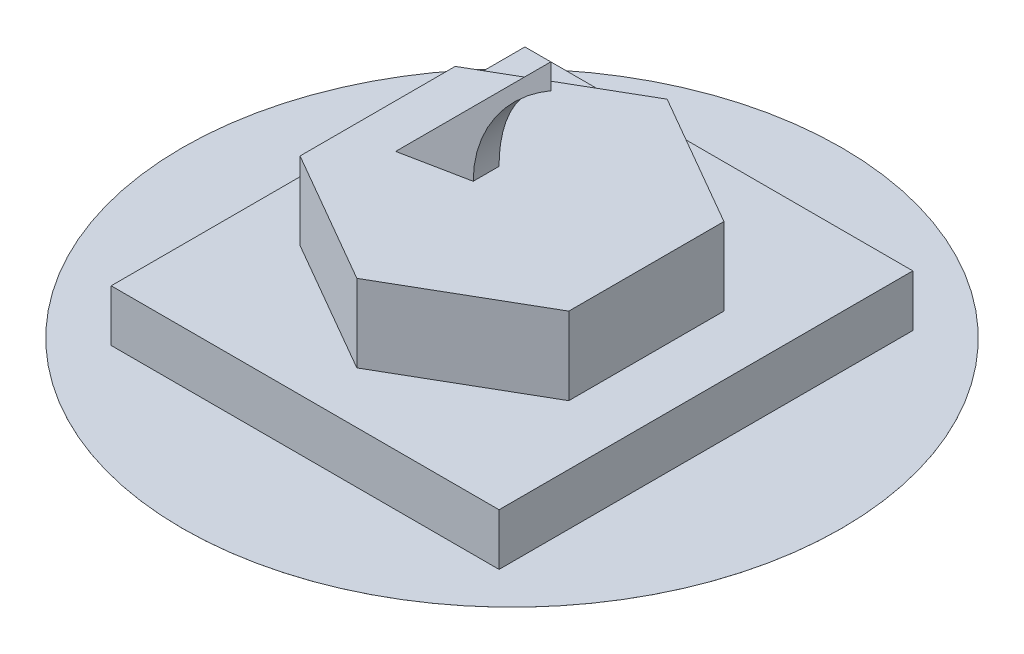
ISO-10303-21;
HEADER;
FILE_DESCRIPTION(('STEP AP214'),'2;1');
FILE_NAME('part.step','',(''),(''),'','','');
FILE_SCHEMA(('AUTOMOTIVE_DESIGN { 1 0 10303 214 1 1 1 1 }'));
ENDSEC;
DATA;
#1=APPLICATION_CONTEXT('core data for automotive mechanical design processes');
#2=APPLICATION_PROTOCOL_DEFINITION('international standard','automotive_design',2000,#1);
#3=PRODUCT_CONTEXT('',#1,'mechanical');
#4=PRODUCT('Part','Part','',(#3));
#5=PRODUCT_RELATED_PRODUCT_CATEGORY('part','',(#4));
#6=PRODUCT_DEFINITION_FORMATION('','',#4);
#7=PRODUCT_DEFINITION_CONTEXT('part definition',#1,'design');
#8=PRODUCT_DEFINITION('design','',#6,#7);
#9=PRODUCT_DEFINITION_SHAPE('','',#8);
#10=(LENGTH_UNIT() NAMED_UNIT(*) SI_UNIT(.MILLI.,.METRE.));
#11=(NAMED_UNIT(*) PLANE_ANGLE_UNIT() SI_UNIT($,.RADIAN.));
#12=(NAMED_UNIT(*) SI_UNIT($,.STERADIAN.) SOLID_ANGLE_UNIT());
#13=UNCERTAINTY_MEASURE_WITH_UNIT(LENGTH_MEASURE(1.E-05),#10,'distance_accuracy_value','');
#14=(GEOMETRIC_REPRESENTATION_CONTEXT(3) GLOBAL_UNCERTAINTY_ASSIGNED_CONTEXT((#13)) GLOBAL_UNIT_ASSIGNED_CONTEXT((#10,
#11,#12)) REPRESENTATION_CONTEXT('',''));
#15=CARTESIAN_POINT('',(0.,0.,0.));
#16=DIRECTION('',(0.,0.,1.));
#17=DIRECTION('',(1.,0.,0.));
#18=AXIS2_PLACEMENT_3D('',#15,#16,#17);
#19=CARTESIAN_POINT('',(75.,50.,-140.));
#20=DIRECTION('',(0.,1.,0.));
#21=DIRECTION('',(0.,0.,1.));
#22=AXIS2_PLACEMENT_3D('',#19,#20,#21);
#23=PLANE('',#22);
#24=DIRECTION('',(0.98058067569092,0.,-0.196116135138184));
#25=VECTOR('',#24,1.);
#26=CARTESIAN_POINT('',(40.,50.,-70.));
#27=LINE('',#26,#25);
#28=CARTESIAN_POINT('',(40.,50.,-70.));
#29=VERTEX_POINT('',#28);
#30=CARTESIAN_POINT('',(65.,50.,-75.));
#31=VERTEX_POINT('',#30);
#32=EDGE_CURVE('E159',#29,#31,#27,.T.);
#33=ORIENTED_EDGE('',*,*,#32,.F.);
#34=DIRECTION('',(0.,0.,1.));
#35=VECTOR('',#34,1.);
#36=CARTESIAN_POINT('',(40.,50.,-90.));
#37=LINE('',#36,#35);
#38=CARTESIAN_POINT('',(40.,50.,-90.));
#39=VERTEX_POINT('',#38);
#40=EDGE_CURVE('E172',#39,#29,#37,.T.);
#41=ORIENTED_EDGE('',*,*,#40,.F.);
#42=DIRECTION('',(-0.98058067569092,0.,-0.196116135138184));
#43=VECTOR('',#42,1.);
#44=CARTESIAN_POINT('',(90.,50.,-80.));
#45=LINE('',#44,#43);
#46=CARTESIAN_POINT('',(65.,50.,-85.));
#47=VERTEX_POINT('',#46);
#48=EDGE_CURVE('E244',#47,#39,#45,.T.);
#49=ORIENTED_EDGE('',*,*,#48,.F.);
#50=DIRECTION('',(0.,0.,1.));
#51=VECTOR('',#50,1.);
#52=CARTESIAN_POINT('',(65.,50.,-160.));
#53=LINE('',#52,#51);
#54=EDGE_CURVE('E241',#47,#31,#53,.T.);
#55=ORIENTED_EDGE('',*,*,#54,.T.);
#56=EDGE_LOOP('',(#33,#41,#49,#55));
#57=FACE_BOUND('',#56,.T.);
#58=DIRECTION('',(0.866025403784439,0.,0.5));
#59=VECTOR('',#58,1.);
#60=CARTESIAN_POINT('',(23.0384757729336,50.,-50.));
#61=LINE('',#60,#59);
#62=CARTESIAN_POINT('',(23.0384757729336,50.,-50.));
#63=VERTEX_POINT('',#62);
#64=CARTESIAN_POINT('',(75.,50.,-20.));
#65=VERTEX_POINT('',#64);
#66=EDGE_CURVE('E183',#63,#65,#61,.T.);
#67=ORIENTED_EDGE('',*,*,#66,.T.);
#68=DIRECTION('',(0.866025403784438,0.,-0.5));
#69=VECTOR('',#68,1.);
#70=CARTESIAN_POINT('',(75.,50.,-20.));
#71=LINE('',#70,#69);
#72=CARTESIAN_POINT('',(126.961524227066,50.,-50.));
#73=VERTEX_POINT('',#72);
#74=EDGE_CURVE('E185',#65,#73,#71,.T.);
#75=ORIENTED_EDGE('',*,*,#74,.T.);
#76=DIRECTION('',(0.,0.,-1.));
#77=VECTOR('',#76,1.);
#78=CARTESIAN_POINT('',(126.961524227066,50.,-50.));
#79=LINE('',#78,#77);
#80=CARTESIAN_POINT('',(126.961524227066,50.,-110.));
#81=VERTEX_POINT('',#80);
#82=EDGE_CURVE('E187',#73,#81,#79,.T.);
#83=ORIENTED_EDGE('',*,*,#82,.T.);
#84=DIRECTION('',(-0.866025403784439,0.,-0.5));
#85=VECTOR('',#84,1.);
#86=CARTESIAN_POINT('',(126.961524227066,50.,-110.));
#87=LINE('',#86,#85);
#88=CARTESIAN_POINT('',(75.,50.,-140.));
#89=VERTEX_POINT('',#88);
#90=EDGE_CURVE('E176',#81,#89,#87,.T.);
#91=ORIENTED_EDGE('',*,*,#90,.T.);
#92=DIRECTION('',(-0.866025403784439,0.,0.5));
#93=VECTOR('',#92,1.);
#94=CARTESIAN_POINT('',(75.,50.,-140.));
#95=LINE('',#94,#93);
#96=CARTESIAN_POINT('',(23.0384757729336,50.,-110.));
#97=VERTEX_POINT('',#96);
#98=EDGE_CURVE('E178',#89,#97,#95,.T.);
#99=ORIENTED_EDGE('',*,*,#98,.T.);
#100=DIRECTION('',(0.,0.,1.));
#101=VECTOR('',#100,1.);
#102=CARTESIAN_POINT('',(23.0384757729336,50.,-110.));
#103=LINE('',#102,#101);
#104=EDGE_CURVE('E181',#97,#63,#103,.T.);
#105=ORIENTED_EDGE('',*,*,#104,.T.);
#106=EDGE_LOOP('',(#67,#75,#83,#91,#99,#105));
#107=FACE_BOUND('',#106,.T.);
#108=ADVANCED_FACE('F30',(#57,#107),#23,.T.);
#109=CARTESIAN_POINT('',(0.,20.,-160.));
#110=DIRECTION('',(0.,-1.,0.));
#111=DIRECTION('',(0.,0.,-1.));
#112=AXIS2_PLACEMENT_3D('',#109,#110,#111);
#113=PLANE('',#112);
#114=DIRECTION('',(0.,0.,1.));
#115=VECTOR('',#114,1.);
#116=CARTESIAN_POINT('',(0.,20.,0.));
#117=LINE('',#116,#115);
#118=CARTESIAN_POINT('',(0.,20.,-160.));
#119=VERTEX_POINT('',#118);
#120=CARTESIAN_POINT('',(0.,20.,0.));
#121=VERTEX_POINT('',#120);
#122=EDGE_CURVE('E220',#119,#121,#117,.T.);
#123=ORIENTED_EDGE('',*,*,#122,.T.);
#124=DIRECTION('',(1.,0.,0.));
#125=VECTOR('',#124,1.);
#126=CARTESIAN_POINT('',(0.,20.,0.));
#127=LINE('',#126,#125);
#128=CARTESIAN_POINT('',(150.,20.,0.));
#129=VERTEX_POINT('',#128);
#130=EDGE_CURVE('E223',#121,#129,#127,.T.);
#131=ORIENTED_EDGE('',*,*,#130,.T.);
#132=DIRECTION('',(0.,0.,-1.));
#133=VECTOR('',#132,1.);
#134=CARTESIAN_POINT('',(150.,20.,0.));
#135=LINE('',#134,#133);
#136=CARTESIAN_POINT('',(150.,20.,-160.));
#137=VERTEX_POINT('',#136);
#138=EDGE_CURVE('E225',#129,#137,#135,.T.);
#139=ORIENTED_EDGE('',*,*,#138,.T.);
#140=DIRECTION('',(-1.,0.,0.));
#141=VECTOR('',#140,1.);
#142=CARTESIAN_POINT('',(0.,20.,-160.));
#143=LINE('',#142,#141);
#144=EDGE_CURVE('E142',#137,#119,#143,.T.);
#145=ORIENTED_EDGE('',*,*,#144,.T.);
#146=EDGE_LOOP('',(#123,#131,#139,#145));
#147=FACE_BOUND('',#146,.T.);
#148=DIRECTION('',(-0.866025403784439,0.,-0.5));
#149=VECTOR('',#148,1.);
#150=CARTESIAN_POINT('',(126.961524227066,20.,-110.));
#151=LINE('',#150,#149);
#152=CARTESIAN_POINT('',(126.961524227066,20.,-110.));
#153=VERTEX_POINT('',#152);
#154=CARTESIAN_POINT('',(75.,20.,-140.));
#155=VERTEX_POINT('',#154);
#156=EDGE_CURVE('E167',#153,#155,#151,.T.);
#157=ORIENTED_EDGE('',*,*,#156,.F.);
#158=DIRECTION('',(0.,0.,-1.));
#159=VECTOR('',#158,1.);
#160=CARTESIAN_POINT('',(126.961524227066,20.,-50.));
#161=LINE('',#160,#159);
#162=CARTESIAN_POINT('',(126.961524227066,20.,-50.));
#163=VERTEX_POINT('',#162);
#164=EDGE_CURVE('E179',#163,#153,#161,.T.);
#165=ORIENTED_EDGE('',*,*,#164,.F.);
#166=DIRECTION('',(0.866025403784438,0.,-0.5));
#167=VECTOR('',#166,1.);
#168=CARTESIAN_POINT('',(75.,20.,-20.));
#169=LINE('',#168,#167);
#170=CARTESIAN_POINT('',(75.,20.,-20.));
#171=VERTEX_POINT('',#170);
#172=EDGE_CURVE('E198',#171,#163,#169,.T.);
#173=ORIENTED_EDGE('',*,*,#172,.F.);
#174=DIRECTION('',(0.866025403784439,0.,0.5));
#175=VECTOR('',#174,1.);
#176=CARTESIAN_POINT('',(23.0384757729336,20.,-50.));
#177=LINE('',#176,#175);
#178=CARTESIAN_POINT('',(23.0384757729336,20.,-50.));
#179=VERTEX_POINT('',#178);
#180=EDGE_CURVE('E195',#179,#171,#177,.T.);
#181=ORIENTED_EDGE('',*,*,#180,.F.);
#182=DIRECTION('',(0.,0.,1.));
#183=VECTOR('',#182,1.);
#184=CARTESIAN_POINT('',(23.0384757729336,20.,-110.));
#185=LINE('',#184,#183);
#186=CARTESIAN_POINT('',(23.0384757729336,20.,-110.));
#187=VERTEX_POINT('',#186);
#188=EDGE_CURVE('E192',#187,#179,#185,.T.);
#189=ORIENTED_EDGE('',*,*,#188,.F.);
#190=DIRECTION('',(-0.866025403784439,0.,0.5));
#191=VECTOR('',#190,1.);
#192=CARTESIAN_POINT('',(75.,20.,-140.));
#193=LINE('',#192,#191);
#194=EDGE_CURVE('E170',#155,#187,#193,.T.);
#195=ORIENTED_EDGE('',*,*,#194,.F.);
#196=EDGE_LOOP('',(#157,#165,#173,#181,#189,#195));
#197=FACE_BOUND('',#196,.T.);
#198=ADVANCED_FACE('F227',(#147,#197),#113,.F.);
#199=CARTESIAN_POINT('',(0.,20.,0.));
#200=DIRECTION('',(1.,0.,0.));
#201=DIRECTION('',(0.,0.,-1.));
#202=AXIS2_PLACEMENT_3D('',#199,#200,#201);
#203=PLANE('',#202);
#204=DIRECTION('',(0.,-1.,0.));
#205=VECTOR('',#204,1.);
#206=CARTESIAN_POINT('',(0.,20.,-160.));
#207=LINE('',#206,#205);
#208=CARTESIAN_POINT('',(0.,0.00999999999999959,-160.));
#209=VERTEX_POINT('',#208);
#210=EDGE_CURVE('E143',#119,#209,#207,.T.);
#211=ORIENTED_EDGE('',*,*,#210,.T.);
#212=DIRECTION('',(0.,0.,1.));
#213=VECTOR('',#212,1.);
#214=CARTESIAN_POINT('',(0.,0.00999999999999959,0.));
#215=LINE('',#214,#213);
#216=CARTESIAN_POINT('',(0.,0.00999999999999959,0.));
#217=VERTEX_POINT('',#216);
#218=EDGE_CURVE('E45',#209,#217,#215,.T.);
#219=ORIENTED_EDGE('',*,*,#218,.T.);
#220=DIRECTION('',(0.,-1.,0.));
#221=VECTOR('',#220,1.);
#222=CARTESIAN_POINT('',(0.,20.,0.));
#223=LINE('',#222,#221);
#224=EDGE_CURVE('E145',#121,#217,#223,.T.);
#225=ORIENTED_EDGE('',*,*,#224,.F.);
#226=ORIENTED_EDGE('',*,*,#122,.F.);
#227=EDGE_LOOP('',(#211,#219,#225,#226));
#228=FACE_BOUND('',#227,.T.);
#229=ADVANCED_FACE('F32',(#228),#203,.F.);
#230=CARTESIAN_POINT('',(0.,20.,0.));
#231=DIRECTION('',(0.,0.,-1.));
#232=DIRECTION('',(-1.,0.,0.));
#233=AXIS2_PLACEMENT_3D('',#230,#231,#232);
#234=PLANE('',#233);
#235=ORIENTED_EDGE('',*,*,#224,.T.);
#236=DIRECTION('',(1.,0.,0.));
#237=VECTOR('',#236,1.);
#238=CARTESIAN_POINT('',(0.,0.00999999999999959,0.));
#239=LINE('',#238,#237);
#240=CARTESIAN_POINT('',(150.,0.00999999999999959,0.));
#241=VERTEX_POINT('',#240);
#242=EDGE_CURVE('E138',#217,#241,#239,.T.);
#243=ORIENTED_EDGE('',*,*,#242,.T.);
#244=DIRECTION('',(0.,-1.,0.));
#245=VECTOR('',#244,1.);
#246=CARTESIAN_POINT('',(150.,20.,0.));
#247=LINE('',#246,#245);
#248=EDGE_CURVE('E137',#129,#241,#247,.T.);
#249=ORIENTED_EDGE('',*,*,#248,.F.);
#250=ORIENTED_EDGE('',*,*,#130,.F.);
#251=EDGE_LOOP('',(#235,#243,#249,#250));
#252=FACE_BOUND('',#251,.T.);
#253=ADVANCED_FACE('F233',(#252),#234,.F.);
#254=CARTESIAN_POINT('',(150.,20.,0.));
#255=DIRECTION('',(-1.,0.,0.));
#256=DIRECTION('',(0.,0.,1.));
#257=AXIS2_PLACEMENT_3D('',#254,#255,#256);
#258=PLANE('',#257);
#259=ORIENTED_EDGE('',*,*,#248,.T.);
#260=DIRECTION('',(0.,0.,-1.));
#261=VECTOR('',#260,1.);
#262=CARTESIAN_POINT('',(150.,0.00999999999999959,0.));
#263=LINE('',#262,#261);
#264=CARTESIAN_POINT('',(150.,0.00999999999999959,-160.));
#265=VERTEX_POINT('',#264);
#266=EDGE_CURVE('E123',#241,#265,#263,.T.);
#267=ORIENTED_EDGE('',*,*,#266,.T.);
#268=DIRECTION('',(0.,-1.,0.));
#269=VECTOR('',#268,1.);
#270=CARTESIAN_POINT('',(150.,20.,-160.));
#271=LINE('',#270,#269);
#272=EDGE_CURVE('E134',#137,#265,#271,.T.);
#273=ORIENTED_EDGE('',*,*,#272,.F.);
#274=ORIENTED_EDGE('',*,*,#138,.F.);
#275=EDGE_LOOP('',(#259,#267,#273,#274));
#276=FACE_BOUND('',#275,.T.);
#277=ADVANCED_FACE('F132',(#276),#258,.F.);
#278=CARTESIAN_POINT('',(0.,20.,-160.));
#279=DIRECTION('',(0.,0.,1.));
#280=DIRECTION('',(1.,0.,0.));
#281=AXIS2_PLACEMENT_3D('',#278,#279,#280);
#282=PLANE('',#281);
#283=ORIENTED_EDGE('',*,*,#272,.T.);
#284=DIRECTION('',(-1.,0.,0.));
#285=VECTOR('',#284,1.);
#286=CARTESIAN_POINT('',(0.,0.00999999999999959,-160.));
#287=LINE('',#286,#285);
#288=EDGE_CURVE('E11',#265,#209,#287,.T.);
#289=ORIENTED_EDGE('',*,*,#288,.T.);
#290=ORIENTED_EDGE('',*,*,#210,.F.);
#291=ORIENTED_EDGE('',*,*,#144,.F.);
#292=EDGE_LOOP('',(#283,#289,#290,#291));
#293=FACE_BOUND('',#292,.T.);
#294=ADVANCED_FACE('F141',(#293),#282,.F.);
#295=CARTESIAN_POINT('',(126.961524227066,50.,-110.));
#296=DIRECTION('',(-0.5,0.,0.866025403784439));
#297=DIRECTION('',(0.866025403784439,0.,0.5));
#298=AXIS2_PLACEMENT_3D('',#295,#296,#297);
#299=PLANE('',#298);
#300=ORIENTED_EDGE('',*,*,#156,.T.);
#301=DIRECTION('',(0.,-1.,0.));
#302=VECTOR('',#301,1.);
#303=CARTESIAN_POINT('',(75.,50.,-140.));
#304=LINE('',#303,#302);
#305=EDGE_CURVE('E217',#89,#155,#304,.T.);
#306=ORIENTED_EDGE('',*,*,#305,.F.);
#307=ORIENTED_EDGE('',*,*,#90,.F.);
#308=DIRECTION('',(0.,-1.,0.));
#309=VECTOR('',#308,1.);
#310=CARTESIAN_POINT('',(126.961524227066,50.,-110.));
#311=LINE('',#310,#309);
#312=EDGE_CURVE('E188',#81,#153,#311,.T.);
#313=ORIENTED_EDGE('',*,*,#312,.T.);
#314=EDGE_LOOP('',(#300,#306,#307,#313));
#315=FACE_BOUND('',#314,.T.);
#316=ADVANCED_FACE('F286',(#315),#299,.F.);
#317=CARTESIAN_POINT('',(75.,50.,-140.));
#318=DIRECTION('',(0.5,0.,0.866025403784439));
#319=DIRECTION('',(0.866025403784439,0.,-0.5));
#320=AXIS2_PLACEMENT_3D('',#317,#318,#319);
#321=PLANE('',#320);
#322=ORIENTED_EDGE('',*,*,#194,.T.);
#323=DIRECTION('',(0.,-1.,0.));
#324=VECTOR('',#323,1.);
#325=CARTESIAN_POINT('',(23.0384757729336,50.,-110.));
#326=LINE('',#325,#324);
#327=EDGE_CURVE('E214',#97,#187,#326,.T.);
#328=ORIENTED_EDGE('',*,*,#327,.F.);
#329=ORIENTED_EDGE('',*,*,#98,.F.);
#330=ORIENTED_EDGE('',*,*,#305,.T.);
#331=EDGE_LOOP('',(#322,#328,#329,#330));
#332=FACE_BOUND('',#331,.T.);
#333=ADVANCED_FACE('F282',(#332),#321,.F.);
#334=CARTESIAN_POINT('',(23.0384757729336,50.,-110.));
#335=DIRECTION('',(1.,0.,0.));
#336=DIRECTION('',(0.,0.,-1.));
#337=AXIS2_PLACEMENT_3D('',#334,#335,#336);
#338=PLANE('',#337);
#339=ORIENTED_EDGE('',*,*,#188,.T.);
#340=DIRECTION('',(0.,-1.,0.));
#341=VECTOR('',#340,1.);
#342=CARTESIAN_POINT('',(23.0384757729336,50.,-50.));
#343=LINE('',#342,#341);
#344=EDGE_CURVE('E211',#63,#179,#343,.T.);
#345=ORIENTED_EDGE('',*,*,#344,.F.);
#346=ORIENTED_EDGE('',*,*,#104,.F.);
#347=ORIENTED_EDGE('',*,*,#327,.T.);
#348=EDGE_LOOP('',(#339,#345,#346,#347));
#349=FACE_BOUND('',#348,.T.);
#350=ADVANCED_FACE('F278',(#349),#338,.F.);
#351=CARTESIAN_POINT('',(23.0384757729336,50.,-50.));
#352=DIRECTION('',(0.5,0.,-0.866025403784439));
#353=DIRECTION('',(-0.866025403784439,0.,-0.5));
#354=AXIS2_PLACEMENT_3D('',#351,#352,#353);
#355=PLANE('',#354);
#356=ORIENTED_EDGE('',*,*,#180,.T.);
#357=DIRECTION('',(0.,-1.,0.));
#358=VECTOR('',#357,1.);
#359=CARTESIAN_POINT('',(75.,50.,-20.));
#360=LINE('',#359,#358);
#361=EDGE_CURVE('E208',#65,#171,#360,.T.);
#362=ORIENTED_EDGE('',*,*,#361,.F.);
#363=ORIENTED_EDGE('',*,*,#66,.F.);
#364=ORIENTED_EDGE('',*,*,#344,.T.);
#365=EDGE_LOOP('',(#356,#362,#363,#364));
#366=FACE_BOUND('',#365,.T.);
#367=ADVANCED_FACE('F274',(#366),#355,.F.);
#368=CARTESIAN_POINT('',(75.,50.,-20.));
#369=DIRECTION('',(-0.5,0.,-0.866025403784438));
#370=DIRECTION('',(-0.866025403784439,0.,0.5));
#371=AXIS2_PLACEMENT_3D('',#368,#369,#370);
#372=PLANE('',#371);
#373=ORIENTED_EDGE('',*,*,#172,.T.);
#374=DIRECTION('',(0.,-1.,0.));
#375=VECTOR('',#374,1.);
#376=CARTESIAN_POINT('',(126.961524227066,50.,-50.));
#377=LINE('',#376,#375);
#378=EDGE_CURVE('E205',#73,#163,#377,.T.);
#379=ORIENTED_EDGE('',*,*,#378,.F.);
#380=ORIENTED_EDGE('',*,*,#74,.F.);
#381=ORIENTED_EDGE('',*,*,#361,.T.);
#382=EDGE_LOOP('',(#373,#379,#380,#381));
#383=FACE_BOUND('',#382,.T.);
#384=ADVANCED_FACE('F270',(#383),#372,.F.);
#385=CARTESIAN_POINT('',(126.961524227066,50.,-50.));
#386=DIRECTION('',(-1.,0.,0.));
#387=DIRECTION('',(0.,0.,1.));
#388=AXIS2_PLACEMENT_3D('',#385,#386,#387);
#389=PLANE('',#388);
#390=ORIENTED_EDGE('',*,*,#164,.T.);
#391=ORIENTED_EDGE('',*,*,#312,.F.);
#392=ORIENTED_EDGE('',*,*,#82,.F.);
#393=ORIENTED_EDGE('',*,*,#378,.T.);
#394=EDGE_LOOP('',(#390,#391,#392,#393));
#395=FACE_BOUND('',#394,.T.);
#396=ADVANCED_FACE('F267',(#395),#389,.F.);
#397=CARTESIAN_POINT('',(90.,100.,-80.));
#398=DIRECTION('',(-0.196116135138184,0.,0.98058067569092));
#399=DIRECTION('',(0.98058067569092,0.,0.196116135138184));
#400=AXIS2_PLACEMENT_3D('',#397,#398,#399);
#401=PLANE('',#400);
#402=ORIENTED_EDGE('',*,*,#48,.T.);
#403=DIRECTION('',(0.700140042014005,0.700140042014005,0.140028008402801));
#404=VECTOR('',#403,1.);
#405=CARTESIAN_POINT('',(90.,100.,-80.));
#406=LINE('',#405,#404);
#407=CARTESIAN_POINT('',(90.,100.,-80.));
#408=VERTEX_POINT('',#407);
#409=EDGE_CURVE('E166',#39,#408,#406,.T.);
#410=ORIENTED_EDGE('',*,*,#409,.T.);
#411=DIRECTION('',(0.,-1.,0.));
#412=VECTOR('',#411,1.);
#413=CARTESIAN_POINT('',(90.,100.,-80.));
#414=LINE('',#413,#412);
#415=CARTESIAN_POINT('',(90.,90.3112887414927,-80.));
#416=VERTEX_POINT('',#415);
#417=EDGE_CURVE('E157',#408,#416,#414,.T.);
#418=ORIENTED_EDGE('',*,*,#417,.T.);
#419=CARTESIAN_POINT('',(110.,50.,-76.));
#420=DIRECTION('',(-0.196116135138184,0.,0.98058067569092));
#421=DIRECTION('',(0.98058067569092,0.,0.196116135138184));
#422=AXIS2_PLACEMENT_3D('',#419,#420,#421);
#423=ELLIPSE('',#422,45.8911756223351,45.);
#424=EDGE_CURVE('E52',#416,#47,#423,.T.);
#425=ORIENTED_EDGE('',*,*,#424,.T.);
#426=EDGE_LOOP('',(#402,#410,#418,#425));
#427=FACE_BOUND('',#426,.T.);
#428=ADVANCED_FACE('F164',(#427),#401,.F.);
#429=CARTESIAN_POINT('',(40.,100.,-70.));
#430=DIRECTION('',(-0.196116135138184,0.,-0.98058067569092));
#431=DIRECTION('',(-0.98058067569092,0.,0.196116135138184));
#432=AXIS2_PLACEMENT_3D('',#429,#430,#431);
#433=PLANE('',#432);
#434=ORIENTED_EDGE('',*,*,#417,.F.);
#435=DIRECTION('',(-0.700140042014005,-0.700140042014005,0.140028008402801));
#436=VECTOR('',#435,1.);
#437=CARTESIAN_POINT('',(64.5098039215686,74.5098039215686,-74.9019607843137));
#438=LINE('',#437,#436);
#439=EDGE_CURVE('E235',#408,#29,#438,.T.);
#440=ORIENTED_EDGE('',*,*,#439,.T.);
#441=ORIENTED_EDGE('',*,*,#32,.T.);
#442=CARTESIAN_POINT('',(110.,50.,-84.));
#443=DIRECTION('',(-0.196116135138184,0.,-0.98058067569092));
#444=DIRECTION('',(-0.98058067569092,0.,0.196116135138184));
#445=AXIS2_PLACEMENT_3D('',#442,#443,#444);
#446=ELLIPSE('',#445,45.8911756223351,45.);
#447=EDGE_CURVE('E38',#31,#416,#446,.T.);
#448=ORIENTED_EDGE('',*,*,#447,.T.);
#449=EDGE_LOOP('',(#434,#440,#441,#448));
#450=FACE_BOUND('',#449,.T.);
#451=ADVANCED_FACE('F155',(#450),#433,.F.);
#452=CARTESIAN_POINT('',(110.,50.,-160.));
#453=DIRECTION('',(0.,0.,1.));
#454=DIRECTION('',(1.,0.,0.));
#455=AXIS2_PLACEMENT_3D('',#452,#453,#454);
#456=CYLINDRICAL_SURFACE('',#455,45.);
#457=ORIENTED_EDGE('',*,*,#447,.F.);
#458=ORIENTED_EDGE('',*,*,#54,.F.);
#459=ORIENTED_EDGE('',*,*,#424,.F.);
#460=EDGE_LOOP('',(#457,#458,#459));
#461=FACE_BOUND('',#460,.T.);
#462=ADVANCED_FACE('F250',(#461),#456,.F.);
#463=CARTESIAN_POINT('',(40.,50.,-160.));
#464=DIRECTION('',(0.707106781186548,-0.707106781186547,0.));
#465=DIRECTION('',(0.707106781186547,0.707106781186548,0.));
#466=AXIS2_PLACEMENT_3D('',#463,#464,#465);
#467=PLANE('',#466);
#468=ORIENTED_EDGE('',*,*,#40,.T.);
#469=ORIENTED_EDGE('',*,*,#439,.F.);
#470=ORIENTED_EDGE('',*,*,#409,.F.);
#471=EDGE_LOOP('',(#468,#469,#470));
#472=FACE_BOUND('',#471,.T.);
#473=ADVANCED_FACE('F247',(#472),#467,.F.);
#474=CARTESIAN_POINT('',(75.,0.01,-80.));
#475=DIRECTION('',(0.,1.,0.));
#476=DIRECTION('',(0.,0.,1.));
#477=AXIS2_PLACEMENT_3D('',#474,#475,#476);
#478=PLANE('',#477);
#479=CARTESIAN_POINT('',(75.,0.01,-80.));
#480=DIRECTION('',(0.,1.,0.));
#481=DIRECTION('',(0.,0.,1.));
#482=AXIS2_PLACEMENT_3D('',#479,#480,#481);
#483=CIRCLE('',#482,127.5);
#484=CARTESIAN_POINT('',(75.,0.01,47.5));
#485=VERTEX_POINT('',#484);
#486=EDGE_CURVE('E139',#485,#485,#483,.T.);
#487=ORIENTED_EDGE('',*,*,#486,.T.);
#488=EDGE_LOOP('',(#487));
#489=FACE_BOUND('',#488,.T.);
#490=ORIENTED_EDGE('',*,*,#218,.F.);
#491=ORIENTED_EDGE('',*,*,#288,.F.);
#492=ORIENTED_EDGE('',*,*,#266,.F.);
#493=ORIENTED_EDGE('',*,*,#242,.F.);
#494=EDGE_LOOP('',(#490,#491,#492,#493));
#495=FACE_BOUND('',#494,.T.);
#496=ADVANCED_FACE('F122',(#489,#495),#478,.T.);
#497=CARTESIAN_POINT('',(75.,0.01,-80.));
#498=DIRECTION('',(0.,-1.,0.));
#499=DIRECTION('',(0.,0.,-1.));
#500=AXIS2_PLACEMENT_3D('',#497,#498,#499);
#501=CYLINDRICAL_SURFACE('',#500,127.5);
#502=ORIENTED_EDGE('',*,*,#486,.F.);
#503=EDGE_LOOP('',(#502));
#504=FACE_BOUND('',#503,.T.);
#505=CARTESIAN_POINT('',(75.,0.,-80.));
#506=DIRECTION('',(0.,1.,0.));
#507=DIRECTION('',(0.,0.,1.));
#508=AXIS2_PLACEMENT_3D('',#505,#506,#507);
#509=CIRCLE('',#508,127.5);
#510=CARTESIAN_POINT('',(75.,0.,47.5));
#511=VERTEX_POINT('',#510);
#512=EDGE_CURVE('E427',#511,#511,#509,.T.);
#513=ORIENTED_EDGE('',*,*,#512,.T.);
#514=EDGE_LOOP('',(#513));
#515=FACE_BOUND('',#514,.T.);
#516=ADVANCED_FACE('F294',(#504,#515),#501,.T.);
#517=CARTESIAN_POINT('',(0.,0.,-160.));
#518=DIRECTION('',(0.,-1.,0.));
#519=DIRECTION('',(0.,0.,-1.));
#520=AXIS2_PLACEMENT_3D('',#517,#518,#519);
#521=PLANE('',#520);
#522=ORIENTED_EDGE('',*,*,#512,.F.);
#523=EDGE_LOOP('',(#522));
#524=FACE_BOUND('',#523,.T.);
#525=ADVANCED_FACE('F291',(#524),#521,.T.);
#526=CLOSED_SHELL('',(#108,#198,#229,#253,#277,#294,#316,#333,#350,#367,#384,#396,#428,#451,
#462,#473,#496,#516,#525));
#527=MANIFOLD_SOLID_BREP('B2',#526);
#528=ADVANCED_BREP_SHAPE_REPRESENTATION('',(#18,#527),#14);
#529=SHAPE_DEFINITION_REPRESENTATION(#9,#528);
ENDSEC;
END-ISO-10303-21;
